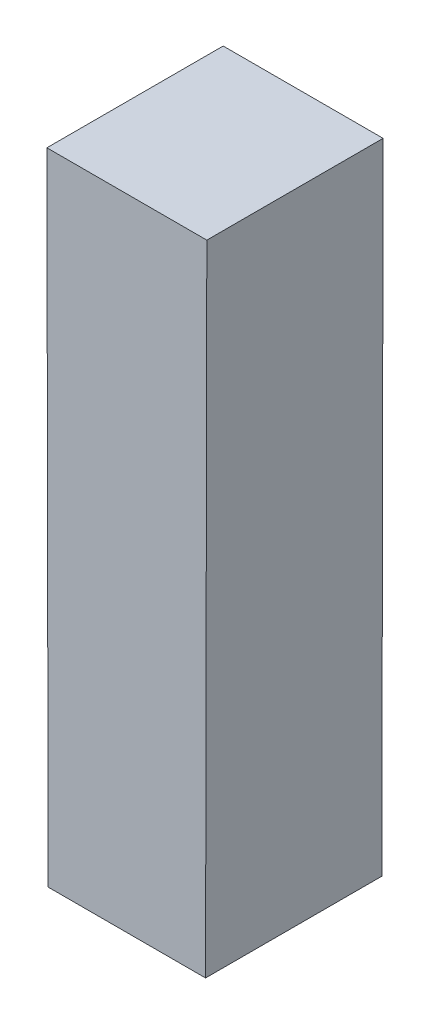
ISO-10303-21;
HEADER;
FILE_DESCRIPTION(('STEP AP214'),'2;1');
FILE_NAME('part.step','',(''),(''),'','','');
FILE_SCHEMA(('AUTOMOTIVE_DESIGN { 1 0 10303 214 1 1 1 1 }'));
ENDSEC;
DATA;
#1=APPLICATION_CONTEXT('core data for automotive mechanical design processes');
#2=APPLICATION_PROTOCOL_DEFINITION('international standard','automotive_design',2000,#1);
#3=PRODUCT_CONTEXT('',#1,'mechanical');
#4=PRODUCT('Part','Part','',(#3));
#5=PRODUCT_RELATED_PRODUCT_CATEGORY('part','',(#4));
#6=PRODUCT_DEFINITION_FORMATION('','',#4);
#7=PRODUCT_DEFINITION_CONTEXT('part definition',#1,'design');
#8=PRODUCT_DEFINITION('design','',#6,#7);
#9=PRODUCT_DEFINITION_SHAPE('','',#8);
#10=(LENGTH_UNIT() NAMED_UNIT(*) SI_UNIT(.MILLI.,.METRE.));
#11=(NAMED_UNIT(*) PLANE_ANGLE_UNIT() SI_UNIT($,.RADIAN.));
#12=(NAMED_UNIT(*) SI_UNIT($,.STERADIAN.) SOLID_ANGLE_UNIT());
#13=UNCERTAINTY_MEASURE_WITH_UNIT(LENGTH_MEASURE(1.E-05),#10,'distance_accuracy_value','');
#14=(GEOMETRIC_REPRESENTATION_CONTEXT(3) GLOBAL_UNCERTAINTY_ASSIGNED_CONTEXT((#13)) GLOBAL_UNIT_ASSIGNED_CONTEXT((#10,
#11,#12)) REPRESENTATION_CONTEXT('',''));
#15=CARTESIAN_POINT('',(0.,0.,0.));
#16=DIRECTION('',(0.,0.,1.));
#17=DIRECTION('',(1.,0.,0.));
#18=AXIS2_PLACEMENT_3D('',#15,#16,#17);
#19=CARTESIAN_POINT('',(1.27,5.08,0.));
#20=DIRECTION('',(0.999998062509506,-0.00196849618604903,0.));
#21=DIRECTION('',(0.00196849618604903,0.999998062509506,0.));
#22=AXIS2_PLACEMENT_3D('',#19,#20,#21);
#23=PLANE('',#22);
#24=DIRECTION('',(0.,0.,-1.));
#25=VECTOR('',#24,1.);
#26=CARTESIAN_POINT('',(1.25000004,-5.08,0.));
#27=LINE('',#26,#25);
#28=CARTESIAN_POINT('',(1.25000004,-5.08,0.));
#29=VERTEX_POINT('',#28);
#30=CARTESIAN_POINT('',(1.25000004,-5.08,2.79999948));
#31=VERTEX_POINT('',#30);
#32=EDGE_CURVE('E57',#29,#31,#27,.F.);
#33=ORIENTED_EDGE('',*,*,#32,.F.);
#34=DIRECTION('',(0.00196849618604998,0.999998062509506,0.));
#35=VECTOR('',#34,1.);
#36=CARTESIAN_POINT('',(1.25000004,-5.08,0.));
#37=LINE('',#36,#35);
#38=CARTESIAN_POINT('',(1.27,5.08,0.));
#39=VERTEX_POINT('',#38);
#40=EDGE_CURVE('E80',#29,#39,#37,.T.);
#41=ORIENTED_EDGE('',*,*,#40,.T.);
#42=DIRECTION('',(0.,0.,1.));
#43=VECTOR('',#42,1.);
#44=CARTESIAN_POINT('',(1.27,5.08,0.));
#45=LINE('',#44,#43);
#46=CARTESIAN_POINT('',(1.27,5.08,2.79999948));
#47=VERTEX_POINT('',#46);
#48=EDGE_CURVE('E20',#39,#47,#45,.T.);
#49=ORIENTED_EDGE('',*,*,#48,.T.);
#50=DIRECTION('',(0.00196849618604998,0.999998062509506,0.));
#51=VECTOR('',#50,1.);
#52=CARTESIAN_POINT('',(1.25000004,-5.08,2.79999948));
#53=LINE('',#52,#51);
#54=EDGE_CURVE('E69',#31,#47,#53,.T.);
#55=ORIENTED_EDGE('',*,*,#54,.F.);
#56=EDGE_LOOP('',(#33,#41,#49,#55));
#57=FACE_BOUND('',#56,.T.);
#58=ADVANCED_FACE('F17',(#57),#23,.T.);
#59=CARTESIAN_POINT('',(1.25000004,-5.08,0.));
#60=DIRECTION('',(0.,-1.,0.));
#61=DIRECTION('',(0.,0.,-1.));
#62=AXIS2_PLACEMENT_3D('',#59,#60,#61);
#63=PLANE('',#62);
#64=DIRECTION('',(0.,0.,1.));
#65=VECTOR('',#64,1.);
#66=CARTESIAN_POINT('',(-1.25000004,-5.08,0.));
#67=LINE('',#66,#65);
#68=CARTESIAN_POINT('',(-1.25000004,-5.08,0.));
#69=VERTEX_POINT('',#68);
#70=CARTESIAN_POINT('',(-1.25000004,-5.08,2.79999948));
#71=VERTEX_POINT('',#70);
#72=EDGE_CURVE('E83',#69,#71,#67,.T.);
#73=ORIENTED_EDGE('',*,*,#72,.F.);
#74=DIRECTION('',(1.,0.,0.));
#75=VECTOR('',#74,1.);
#76=CARTESIAN_POINT('',(-1.25000004,-5.08,0.));
#77=LINE('',#76,#75);
#78=EDGE_CURVE('E64',#69,#29,#77,.T.);
#79=ORIENTED_EDGE('',*,*,#78,.T.);
#80=ORIENTED_EDGE('',*,*,#32,.T.);
#81=DIRECTION('',(1.,0.,0.));
#82=VECTOR('',#81,1.);
#83=CARTESIAN_POINT('',(-1.25000004,-5.08,2.79999948));
#84=LINE('',#83,#82);
#85=EDGE_CURVE('E61',#71,#31,#84,.T.);
#86=ORIENTED_EDGE('',*,*,#85,.F.);
#87=EDGE_LOOP('',(#73,#79,#80,#86));
#88=FACE_BOUND('',#87,.T.);
#89=ADVANCED_FACE('F59',(#88),#63,.T.);
#90=CARTESIAN_POINT('',(-1.25000004,-5.08,2.79999948));
#91=DIRECTION('',(0.,0.,1.));
#92=DIRECTION('',(1.,0.,0.));
#93=AXIS2_PLACEMENT_3D('',#90,#91,#92);
#94=PLANE('',#93);
#95=DIRECTION('',(1.,0.,0.));
#96=VECTOR('',#95,1.);
#97=CARTESIAN_POINT('',(-1.27,5.08,2.79999948));
#98=LINE('',#97,#96);
#99=CARTESIAN_POINT('',(-1.27,5.08,2.79999948));
#100=VERTEX_POINT('',#99);
#101=EDGE_CURVE('E52',#100,#47,#98,.T.);
#102=ORIENTED_EDGE('',*,*,#101,.F.);
#103=DIRECTION('',(0.00196849618604903,-0.999998062509506,0.));
#104=VECTOR('',#103,1.);
#105=CARTESIAN_POINT('',(-1.25000004,-5.08,2.79999948));
#106=LINE('',#105,#104);
#107=EDGE_CURVE('E74',#71,#100,#106,.F.);
#108=ORIENTED_EDGE('',*,*,#107,.F.);
#109=ORIENTED_EDGE('',*,*,#85,.T.);
#110=ORIENTED_EDGE('',*,*,#54,.T.);
#111=EDGE_LOOP('',(#102,#108,#109,#110));
#112=FACE_BOUND('',#111,.T.);
#113=ADVANCED_FACE('F72',(#112),#94,.T.);
#114=CARTESIAN_POINT('',(-1.27,5.08,0.));
#115=DIRECTION('',(0.,1.,0.));
#116=DIRECTION('',(0.,0.,1.));
#117=AXIS2_PLACEMENT_3D('',#114,#115,#116);
#118=PLANE('',#117);
#119=ORIENTED_EDGE('',*,*,#101,.T.);
#120=ORIENTED_EDGE('',*,*,#48,.F.);
#121=DIRECTION('',(1.,0.,0.));
#122=VECTOR('',#121,1.);
#123=CARTESIAN_POINT('',(-1.25000004,5.08,0.));
#124=LINE('',#123,#122);
#125=CARTESIAN_POINT('',(-1.27,5.08,0.));
#126=VERTEX_POINT('',#125);
#127=EDGE_CURVE('E35',#39,#126,#124,.F.);
#128=ORIENTED_EDGE('',*,*,#127,.T.);
#129=DIRECTION('',(0.,0.,1.));
#130=VECTOR('',#129,1.);
#131=CARTESIAN_POINT('',(-1.26999999999999,5.08,0.));
#132=LINE('',#131,#130);
#133=EDGE_CURVE('E26',#100,#126,#132,.F.);
#134=ORIENTED_EDGE('',*,*,#133,.F.);
#135=EDGE_LOOP('',(#119,#120,#128,#134));
#136=FACE_BOUND('',#135,.T.);
#137=ADVANCED_FACE('F89',(#136),#118,.T.);
#138=CARTESIAN_POINT('',(-1.25000004,-5.08,0.));
#139=DIRECTION('',(0.,0.,1.));
#140=DIRECTION('',(1.,0.,0.));
#141=AXIS2_PLACEMENT_3D('',#138,#139,#140);
#142=PLANE('',#141);
#143=ORIENTED_EDGE('',*,*,#127,.F.);
#144=ORIENTED_EDGE('',*,*,#40,.F.);
#145=ORIENTED_EDGE('',*,*,#78,.F.);
#146=DIRECTION('',(0.00196849618604903,-0.999998062509506,0.));
#147=VECTOR('',#146,1.);
#148=CARTESIAN_POINT('',(-1.25000004,-5.08,0.));
#149=LINE('',#148,#147);
#150=EDGE_CURVE('E11',#126,#69,#149,.T.);
#151=ORIENTED_EDGE('',*,*,#150,.F.);
#152=EDGE_LOOP('',(#143,#144,#145,#151));
#153=FACE_BOUND('',#152,.T.);
#154=ADVANCED_FACE('F91',(#153),#142,.F.);
#155=CARTESIAN_POINT('',(-1.25000004,-5.08,0.));
#156=DIRECTION('',(-0.999998062509506,-0.00196849618604903,0.));
#157=DIRECTION('',(0.00196849618604903,-0.999998062509506,0.));
#158=AXIS2_PLACEMENT_3D('',#155,#156,#157);
#159=PLANE('',#158);
#160=ORIENTED_EDGE('',*,*,#133,.T.);
#161=ORIENTED_EDGE('',*,*,#150,.T.);
#162=ORIENTED_EDGE('',*,*,#72,.T.);
#163=ORIENTED_EDGE('',*,*,#107,.T.);
#164=EDGE_LOOP('',(#160,#161,#162,#163));
#165=FACE_BOUND('',#164,.T.);
#166=ADVANCED_FACE('F88',(#165),#159,.T.);
#167=CLOSED_SHELL('',(#58,#89,#113,#137,#154,#166));
#168=MANIFOLD_SOLID_BREP('B1',#167);
#169=ADVANCED_BREP_SHAPE_REPRESENTATION('',(#18,#168),#14);
#170=SHAPE_DEFINITION_REPRESENTATION(#9,#169);
ENDSEC;
END-ISO-10303-21;
